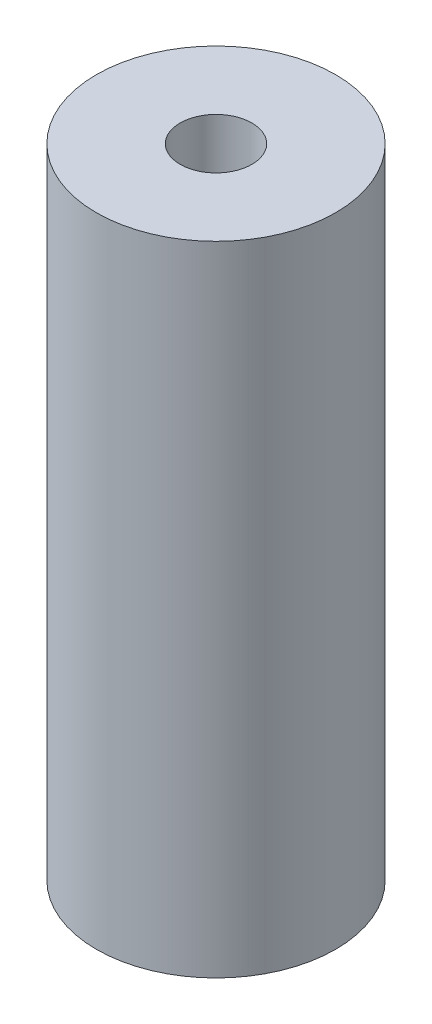
ISO-10303-21;
HEADER;
FILE_DESCRIPTION(('STEP AP214'),'2;1');
FILE_NAME('part.step','',(''),(''),'','','');
FILE_SCHEMA(('AUTOMOTIVE_DESIGN { 1 0 10303 214 1 1 1 1 }'));
ENDSEC;
DATA;
#1=APPLICATION_CONTEXT('core data for automotive mechanical design processes');
#2=APPLICATION_PROTOCOL_DEFINITION('international standard','automotive_design',2000,#1);
#3=PRODUCT_CONTEXT('',#1,'mechanical');
#4=PRODUCT('Part','Part','',(#3));
#5=PRODUCT_RELATED_PRODUCT_CATEGORY('part','',(#4));
#6=PRODUCT_DEFINITION_FORMATION('','',#4);
#7=PRODUCT_DEFINITION_CONTEXT('part definition',#1,'design');
#8=PRODUCT_DEFINITION('design','',#6,#7);
#9=PRODUCT_DEFINITION_SHAPE('','',#8);
#10=(LENGTH_UNIT() NAMED_UNIT(*) SI_UNIT(.MILLI.,.METRE.));
#11=(NAMED_UNIT(*) PLANE_ANGLE_UNIT() SI_UNIT($,.RADIAN.));
#12=(NAMED_UNIT(*) SI_UNIT($,.STERADIAN.) SOLID_ANGLE_UNIT());
#13=UNCERTAINTY_MEASURE_WITH_UNIT(LENGTH_MEASURE(1.E-05),#10,'distance_accuracy_value','');
#14=(GEOMETRIC_REPRESENTATION_CONTEXT(3) GLOBAL_UNCERTAINTY_ASSIGNED_CONTEXT((#13)) GLOBAL_UNIT_ASSIGNED_CONTEXT((#10,
#11,#12)) REPRESENTATION_CONTEXT('',''));
#15=CARTESIAN_POINT('',(0.,0.,0.));
#16=DIRECTION('',(0.,0.,1.));
#17=DIRECTION('',(1.,0.,0.));
#18=AXIS2_PLACEMENT_3D('',#15,#16,#17);
#19=CARTESIAN_POINT('',(0.,40.,0.));
#20=DIRECTION('',(0.,1.,0.));
#21=DIRECTION('',(0.,0.,1.));
#22=AXIS2_PLACEMENT_3D('',#19,#20,#21);
#23=PLANE('',#22);
#24=CARTESIAN_POINT('',(0.,40.,0.));
#25=DIRECTION('',(0.,1.,0.));
#26=DIRECTION('',(0.,0.,1.));
#27=AXIS2_PLACEMENT_3D('',#24,#25,#26);
#28=CIRCLE('',#27,7.5);
#29=CARTESIAN_POINT('',(0.,40.,7.5));
#30=VERTEX_POINT('',#29);
#31=EDGE_CURVE('E10',#30,#30,#28,.T.);
#32=ORIENTED_EDGE('',*,*,#31,.T.);
#33=EDGE_LOOP('',(#32));
#34=FACE_BOUND('',#33,.T.);
#35=CARTESIAN_POINT('',(0.,40.,0.));
#36=DIRECTION('',(0.,1.,0.));
#37=DIRECTION('',(0.,0.,1.));
#38=AXIS2_PLACEMENT_3D('',#35,#36,#37);
#39=CIRCLE('',#38,2.25);
#40=CARTESIAN_POINT('',(0.,40.,2.25));
#41=VERTEX_POINT('',#40);
#42=EDGE_CURVE('E46',#41,#41,#39,.T.);
#43=ORIENTED_EDGE('',*,*,#42,.F.);
#44=EDGE_LOOP('',(#43));
#45=FACE_BOUND('',#44,.T.);
#46=ADVANCED_FACE('F35',(#34,#45),#23,.T.);
#47=CARTESIAN_POINT('',(0.,0.,0.));
#48=DIRECTION('',(0.,1.,0.));
#49=DIRECTION('',(0.,0.,1.));
#50=AXIS2_PLACEMENT_3D('',#47,#48,#49);
#51=PLANE('',#50);
#52=CARTESIAN_POINT('',(0.,0.,0.));
#53=DIRECTION('',(0.,1.,0.));
#54=DIRECTION('',(0.,0.,1.));
#55=AXIS2_PLACEMENT_3D('',#52,#53,#54);
#56=CIRCLE('',#55,7.5);
#57=CARTESIAN_POINT('',(0.,0.,7.5));
#58=VERTEX_POINT('',#57);
#59=EDGE_CURVE('E39',#58,#58,#56,.T.);
#60=ORIENTED_EDGE('',*,*,#59,.F.);
#61=EDGE_LOOP('',(#60));
#62=FACE_BOUND('',#61,.T.);
#63=CARTESIAN_POINT('',(0.,0.,0.));
#64=DIRECTION('',(0.,1.,0.));
#65=DIRECTION('',(0.,0.,1.));
#66=AXIS2_PLACEMENT_3D('',#63,#64,#65);
#67=CIRCLE('',#66,2.25);
#68=CARTESIAN_POINT('',(0.,0.,2.25));
#69=VERTEX_POINT('',#68);
#70=EDGE_CURVE('E48',#69,#69,#67,.T.);
#71=ORIENTED_EDGE('',*,*,#70,.T.);
#72=EDGE_LOOP('',(#71));
#73=FACE_BOUND('',#72,.T.);
#74=ADVANCED_FACE('F58',(#62,#73),#51,.F.);
#75=CARTESIAN_POINT('',(0.,40.,0.));
#76=DIRECTION('',(0.,-1.,0.));
#77=DIRECTION('',(0.,0.,-1.));
#78=AXIS2_PLACEMENT_3D('',#75,#76,#77);
#79=CYLINDRICAL_SURFACE('',#78,7.5);
#80=ORIENTED_EDGE('',*,*,#31,.F.);
#81=EDGE_LOOP('',(#80));
#82=FACE_BOUND('',#81,.T.);
#83=ORIENTED_EDGE('',*,*,#59,.T.);
#84=EDGE_LOOP('',(#83));
#85=FACE_BOUND('',#84,.T.);
#86=ADVANCED_FACE('F37',(#82,#85),#79,.T.);
#87=CARTESIAN_POINT('',(0.,40.,0.));
#88=DIRECTION('',(0.,-1.,0.));
#89=DIRECTION('',(0.,0.,-1.));
#90=AXIS2_PLACEMENT_3D('',#87,#88,#89);
#91=CYLINDRICAL_SURFACE('',#90,2.25);
#92=ORIENTED_EDGE('',*,*,#42,.T.);
#93=EDGE_LOOP('',(#92));
#94=FACE_BOUND('',#93,.T.);
#95=ORIENTED_EDGE('',*,*,#70,.F.);
#96=EDGE_LOOP('',(#95));
#97=FACE_BOUND('',#96,.T.);
#98=ADVANCED_FACE('F54',(#94,#97),#91,.F.);
#99=CLOSED_SHELL('',(#46,#74,#86,#98));
#100=MANIFOLD_SOLID_BREP('B2',#99);
#101=ADVANCED_BREP_SHAPE_REPRESENTATION('',(#18,#100),#14);
#102=SHAPE_DEFINITION_REPRESENTATION(#9,#101);
ENDSEC;
END-ISO-10303-21;
